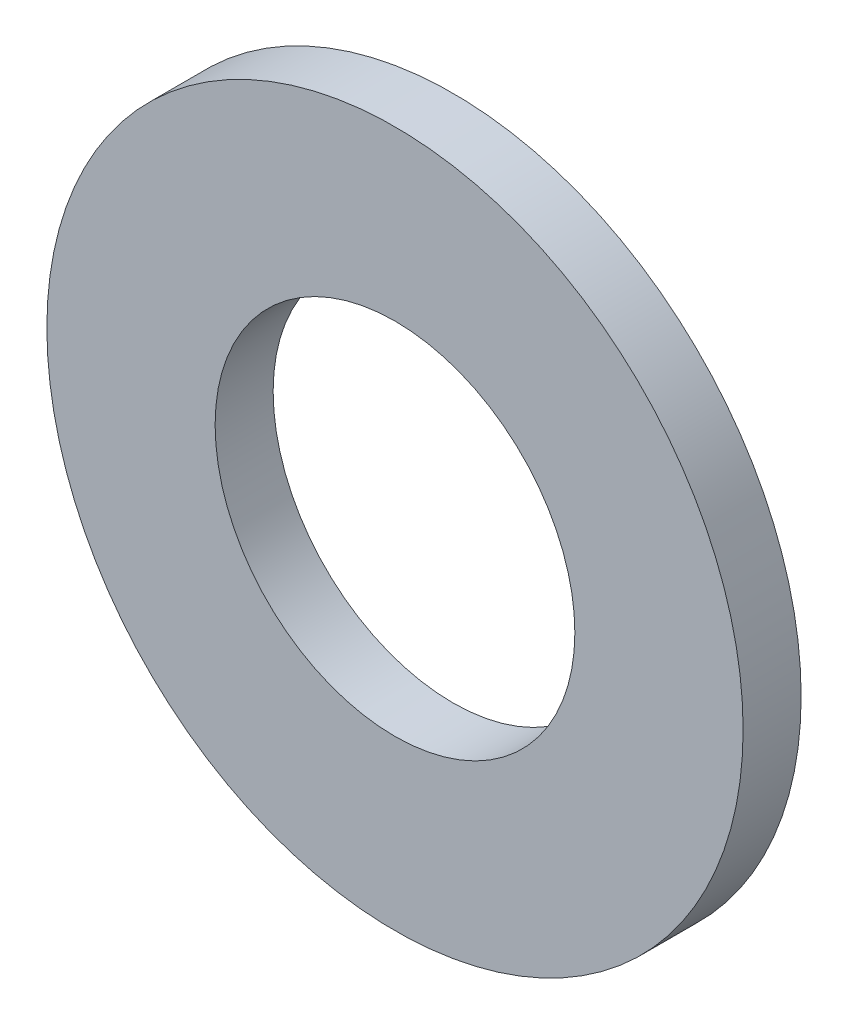
ISO-10303-21;
HEADER;
FILE_DESCRIPTION(('STEP AP214'),'2;1');
FILE_NAME('part.step','',(''),(''),'','','');
FILE_SCHEMA(('AUTOMOTIVE_DESIGN { 1 0 10303 214 1 1 1 1 }'));
ENDSEC;
DATA;
#1=APPLICATION_CONTEXT('core data for automotive mechanical design processes');
#2=APPLICATION_PROTOCOL_DEFINITION('international standard','automotive_design',2000,#1);
#3=PRODUCT_CONTEXT('',#1,'mechanical');
#4=PRODUCT('Part','Part','',(#3));
#5=PRODUCT_RELATED_PRODUCT_CATEGORY('part','',(#4));
#6=PRODUCT_DEFINITION_FORMATION('','',#4);
#7=PRODUCT_DEFINITION_CONTEXT('part definition',#1,'design');
#8=PRODUCT_DEFINITION('design','',#6,#7);
#9=PRODUCT_DEFINITION_SHAPE('','',#8);
#10=(LENGTH_UNIT() NAMED_UNIT(*) SI_UNIT(.MILLI.,.METRE.));
#11=(NAMED_UNIT(*) PLANE_ANGLE_UNIT() SI_UNIT($,.RADIAN.));
#12=(NAMED_UNIT(*) SI_UNIT($,.STERADIAN.) SOLID_ANGLE_UNIT());
#13=UNCERTAINTY_MEASURE_WITH_UNIT(LENGTH_MEASURE(1.E-05),#10,'distance_accuracy_value','');
#14=(GEOMETRIC_REPRESENTATION_CONTEXT(3) GLOBAL_UNCERTAINTY_ASSIGNED_CONTEXT((#13)) GLOBAL_UNIT_ASSIGNED_CONTEXT((#10,
#11,#12)) REPRESENTATION_CONTEXT('',''));
#15=CARTESIAN_POINT('',(0.,0.,0.));
#16=DIRECTION('',(0.,0.,1.));
#17=DIRECTION('',(1.,0.,0.));
#18=AXIS2_PLACEMENT_3D('',#15,#16,#17);
#19=CARTESIAN_POINT('',(0.,0.,0.5));
#20=DIRECTION('',(0.,0.,1.));
#21=DIRECTION('',(1.,0.,0.));
#22=AXIS2_PLACEMENT_3D('',#19,#20,#21);
#23=PLANE('',#22);
#24=CARTESIAN_POINT('',(0.,0.,0.5));
#25=DIRECTION('',(0.,0.,1.));
#26=DIRECTION('',(1.,0.,0.));
#27=AXIS2_PLACEMENT_3D('',#24,#25,#26);
#28=CIRCLE('',#27,3.);
#29=CARTESIAN_POINT('',(3.,0.,0.5));
#30=VERTEX_POINT('',#29);
#31=EDGE_CURVE('E10',#30,#30,#28,.T.);
#32=ORIENTED_EDGE('',*,*,#31,.T.);
#33=EDGE_LOOP('',(#32));
#34=FACE_BOUND('',#33,.T.);
#35=CARTESIAN_POINT('',(0.,0.,0.5));
#36=DIRECTION('',(0.,0.,1.));
#37=DIRECTION('',(1.,0.,0.));
#38=AXIS2_PLACEMENT_3D('',#35,#36,#37);
#39=CIRCLE('',#38,1.55);
#40=CARTESIAN_POINT('',(1.55,0.,0.5));
#41=VERTEX_POINT('',#40);
#42=EDGE_CURVE('E42',#41,#41,#39,.T.);
#43=ORIENTED_EDGE('',*,*,#42,.F.);
#44=EDGE_LOOP('',(#43));
#45=FACE_BOUND('',#44,.T.);
#46=ADVANCED_FACE('F31',(#34,#45),#23,.T.);
#47=CARTESIAN_POINT('',(0.,0.,0.));
#48=DIRECTION('',(0.,0.,1.));
#49=DIRECTION('',(1.,0.,0.));
#50=AXIS2_PLACEMENT_3D('',#47,#48,#49);
#51=PLANE('',#50);
#52=CARTESIAN_POINT('',(0.,0.,0.));
#53=DIRECTION('',(0.,0.,1.));
#54=DIRECTION('',(1.,0.,0.));
#55=AXIS2_PLACEMENT_3D('',#52,#53,#54);
#56=CIRCLE('',#55,3.);
#57=CARTESIAN_POINT('',(3.,0.,0.));
#58=VERTEX_POINT('',#57);
#59=EDGE_CURVE('E35',#58,#58,#56,.T.);
#60=ORIENTED_EDGE('',*,*,#59,.F.);
#61=EDGE_LOOP('',(#60));
#62=FACE_BOUND('',#61,.T.);
#63=CARTESIAN_POINT('',(0.,0.,0.));
#64=DIRECTION('',(0.,0.,1.));
#65=DIRECTION('',(1.,0.,0.));
#66=AXIS2_PLACEMENT_3D('',#63,#64,#65);
#67=CIRCLE('',#66,1.55);
#68=CARTESIAN_POINT('',(1.55,0.,0.));
#69=VERTEX_POINT('',#68);
#70=EDGE_CURVE('E44',#69,#69,#67,.T.);
#71=ORIENTED_EDGE('',*,*,#70,.T.);
#72=EDGE_LOOP('',(#71));
#73=FACE_BOUND('',#72,.T.);
#74=ADVANCED_FACE('F54',(#62,#73),#51,.F.);
#75=CARTESIAN_POINT('',(0.,0.,0.5));
#76=DIRECTION('',(0.,0.,-1.));
#77=DIRECTION('',(-1.,0.,0.));
#78=AXIS2_PLACEMENT_3D('',#75,#76,#77);
#79=CYLINDRICAL_SURFACE('',#78,3.);
#80=ORIENTED_EDGE('',*,*,#31,.F.);
#81=EDGE_LOOP('',(#80));
#82=FACE_BOUND('',#81,.T.);
#83=ORIENTED_EDGE('',*,*,#59,.T.);
#84=EDGE_LOOP('',(#83));
#85=FACE_BOUND('',#84,.T.);
#86=ADVANCED_FACE('F33',(#82,#85),#79,.T.);
#87=CARTESIAN_POINT('',(0.,0.,0.5));
#88=DIRECTION('',(0.,0.,-1.));
#89=DIRECTION('',(-1.,0.,0.));
#90=AXIS2_PLACEMENT_3D('',#87,#88,#89);
#91=CYLINDRICAL_SURFACE('',#90,1.55);
#92=ORIENTED_EDGE('',*,*,#42,.T.);
#93=EDGE_LOOP('',(#92));
#94=FACE_BOUND('',#93,.T.);
#95=ORIENTED_EDGE('',*,*,#70,.F.);
#96=EDGE_LOOP('',(#95));
#97=FACE_BOUND('',#96,.T.);
#98=ADVANCED_FACE('F50',(#94,#97),#91,.F.);
#99=CLOSED_SHELL('',(#46,#74,#86,#98));
#100=MANIFOLD_SOLID_BREP('B2',#99);
#101=ADVANCED_BREP_SHAPE_REPRESENTATION('',(#18,#100),#14);
#102=SHAPE_DEFINITION_REPRESENTATION(#9,#101);
ENDSEC;
END-ISO-10303-21;
